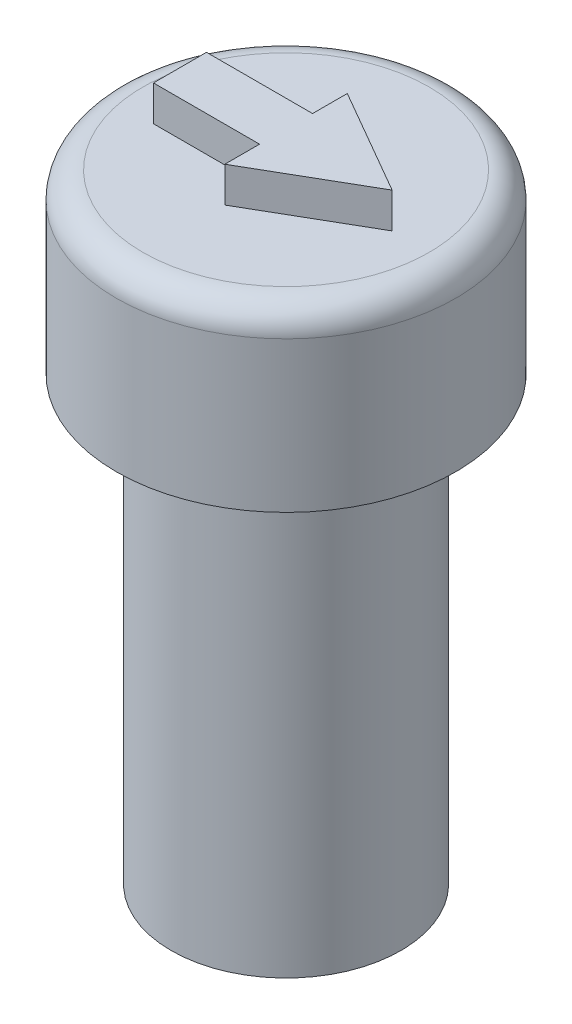
ISO-10303-21;
HEADER;
FILE_DESCRIPTION(('STEP AP214'),'2;1');
FILE_NAME('part.step','',(''),(''),'','','');
FILE_SCHEMA(('AUTOMOTIVE_DESIGN { 1 0 10303 214 1 1 1 1 }'));
ENDSEC;
DATA;
#1=APPLICATION_CONTEXT('core data for automotive mechanical design processes');
#2=APPLICATION_PROTOCOL_DEFINITION('international standard','automotive_design',2000,#1);
#3=PRODUCT_CONTEXT('',#1,'mechanical');
#4=PRODUCT('Part','Part','',(#3));
#5=PRODUCT_RELATED_PRODUCT_CATEGORY('part','',(#4));
#6=PRODUCT_DEFINITION_FORMATION('','',#4);
#7=PRODUCT_DEFINITION_CONTEXT('part definition',#1,'design');
#8=PRODUCT_DEFINITION('design','',#6,#7);
#9=PRODUCT_DEFINITION_SHAPE('','',#8);
#10=(LENGTH_UNIT() NAMED_UNIT(*) SI_UNIT(.MILLI.,.METRE.));
#11=(NAMED_UNIT(*) PLANE_ANGLE_UNIT() SI_UNIT($,.RADIAN.));
#12=(NAMED_UNIT(*) SI_UNIT($,.STERADIAN.) SOLID_ANGLE_UNIT());
#13=UNCERTAINTY_MEASURE_WITH_UNIT(LENGTH_MEASURE(1.E-05),#10,'distance_accuracy_value','');
#14=(GEOMETRIC_REPRESENTATION_CONTEXT(3) GLOBAL_UNCERTAINTY_ASSIGNED_CONTEXT((#13)) GLOBAL_UNIT_ASSIGNED_CONTEXT((#10,
#11,#12)) REPRESENTATION_CONTEXT('',''));
#15=CARTESIAN_POINT('',(0.,0.,0.));
#16=DIRECTION('',(0.,0.,1.));
#17=DIRECTION('',(1.,0.,0.));
#18=AXIS2_PLACEMENT_3D('',#15,#16,#17);
#19=CARTESIAN_POINT('',(0.,17.5,0.));
#20=DIRECTION('',(0.,1.,0.));
#21=DIRECTION('',(0.,0.,1.));
#22=AXIS2_PLACEMENT_3D('',#19,#20,#21);
#23=PLANE('',#22);
#24=CARTESIAN_POINT('',(0.,17.5,0.));
#25=DIRECTION('',(0.,1.,0.));
#26=DIRECTION('',(0.,0.,1.));
#27=AXIS2_PLACEMENT_3D('',#24,#25,#26);
#28=CIRCLE('',#27,4.05);
#29=CARTESIAN_POINT('',(0.,17.5,4.05));
#30=VERTEX_POINT('',#29);
#31=EDGE_CURVE('E110',#30,#30,#28,.T.);
#32=ORIENTED_EDGE('',*,*,#31,.T.);
#33=EDGE_LOOP('',(#32));
#34=FACE_BOUND('',#33,.T.);
#35=DIRECTION('',(-1.,0.,0.));
#36=VECTOR('',#35,1.);
#37=CARTESIAN_POINT('',(0.,17.5,-0.75));
#38=LINE('',#37,#36);
#39=CARTESIAN_POINT('',(0.,17.5,-0.75));
#40=VERTEX_POINT('',#39);
#41=CARTESIAN_POINT('',(-3.,17.5,-0.75));
#42=VERTEX_POINT('',#41);
#43=EDGE_CURVE('E200',#40,#42,#38,.T.);
#44=ORIENTED_EDGE('',*,*,#43,.F.);
#45=DIRECTION('',(0.,0.,1.));
#46=VECTOR('',#45,1.);
#47=CARTESIAN_POINT('',(0.,17.5,-1.73205080756888));
#48=LINE('',#47,#46);
#49=CARTESIAN_POINT('',(0.,17.5,-1.73205080756888));
#50=VERTEX_POINT('',#49);
#51=EDGE_CURVE('E196',#50,#40,#48,.T.);
#52=ORIENTED_EDGE('',*,*,#51,.F.);
#53=DIRECTION('',(-0.866025403784438,0.,-0.5));
#54=VECTOR('',#53,1.);
#55=CARTESIAN_POINT('',(3.,17.5,0.));
#56=LINE('',#55,#54);
#57=CARTESIAN_POINT('',(3.,17.5,0.));
#58=VERTEX_POINT('',#57);
#59=EDGE_CURVE('E148',#58,#50,#56,.T.);
#60=ORIENTED_EDGE('',*,*,#59,.F.);
#61=DIRECTION('',(0.866025403784439,0.,-0.5));
#62=VECTOR('',#61,1.);
#63=CARTESIAN_POINT('',(0.,17.5,1.73205080756888));
#64=LINE('',#63,#62);
#65=CARTESIAN_POINT('',(0.,17.5,1.73205080756888));
#66=VERTEX_POINT('',#65);
#67=EDGE_CURVE('E211',#66,#58,#64,.T.);
#68=ORIENTED_EDGE('',*,*,#67,.F.);
#69=DIRECTION('',(0.,0.,1.));
#70=VECTOR('',#69,1.);
#71=CARTESIAN_POINT('',(0.,17.5,0.75));
#72=LINE('',#71,#70);
#73=CARTESIAN_POINT('',(0.,17.5,0.75));
#74=VERTEX_POINT('',#73);
#75=EDGE_CURVE('E182',#74,#66,#72,.T.);
#76=ORIENTED_EDGE('',*,*,#75,.F.);
#77=DIRECTION('',(1.,0.,0.));
#78=VECTOR('',#77,1.);
#79=CARTESIAN_POINT('',(-3.,17.5,0.75));
#80=LINE('',#79,#78);
#81=CARTESIAN_POINT('',(-3.,17.5,0.75));
#82=VERTEX_POINT('',#81);
#83=EDGE_CURVE('E206',#82,#74,#80,.T.);
#84=ORIENTED_EDGE('',*,*,#83,.F.);
#85=DIRECTION('',(0.,0.,1.));
#86=VECTOR('',#85,1.);
#87=CARTESIAN_POINT('',(-3.,17.5,-0.75));
#88=LINE('',#87,#86);
#89=EDGE_CURVE('E203',#42,#82,#88,.T.);
#90=ORIENTED_EDGE('',*,*,#89,.F.);
#91=EDGE_LOOP('',(#44,#52,#60,#68,#76,#84,#90));
#92=FACE_BOUND('',#91,.T.);
#93=ADVANCED_FACE('F101',(#34,#92),#23,.T.);
#94=CARTESIAN_POINT('',(0.,12.5,0.));
#95=DIRECTION('',(0.,-1.,0.));
#96=DIRECTION('',(0.,0.,-1.));
#97=AXIS2_PLACEMENT_3D('',#94,#95,#96);
#98=CYLINDRICAL_SURFACE('',#97,3.25);
#99=CARTESIAN_POINT('',(0.,12.5,0.));
#100=DIRECTION('',(0.,1.,0.));
#101=DIRECTION('',(0.,0.,1.));
#102=AXIS2_PLACEMENT_3D('',#99,#100,#101);
#103=CIRCLE('',#102,3.25);
#104=CARTESIAN_POINT('',(0.,12.5,3.25));
#105=VERTEX_POINT('',#104);
#106=EDGE_CURVE('E247',#105,#105,#103,.T.);
#107=ORIENTED_EDGE('',*,*,#106,.F.);
#108=EDGE_LOOP('',(#107));
#109=FACE_BOUND('',#108,.T.);
#110=CARTESIAN_POINT('',(0.,0.,0.));
#111=DIRECTION('',(0.,1.,0.));
#112=DIRECTION('',(0.,0.,1.));
#113=AXIS2_PLACEMENT_3D('',#110,#111,#112);
#114=CIRCLE('',#113,3.25);
#115=CARTESIAN_POINT('',(0.,0.,3.25));
#116=VERTEX_POINT('',#115);
#117=EDGE_CURVE('E243',#116,#116,#114,.T.);
#118=ORIENTED_EDGE('',*,*,#117,.T.);
#119=EDGE_LOOP('',(#118));
#120=FACE_BOUND('',#119,.T.);
#121=ADVANCED_FACE('F276',(#109,#120),#98,.T.);
#122=CARTESIAN_POINT('',(0.,0.,0.));
#123=DIRECTION('',(0.,1.,0.));
#124=DIRECTION('',(0.,0.,1.));
#125=AXIS2_PLACEMENT_3D('',#122,#123,#124);
#126=PLANE('',#125);
#127=CARTESIAN_POINT('',(0.,0.,0.));
#128=DIRECTION('',(0.,-1.,0.));
#129=DIRECTION('',(0.,0.,-1.));
#130=AXIS2_PLACEMENT_3D('',#127,#128,#129);
#131=CIRCLE('',#130,1.75);
#132=CARTESIAN_POINT('',(0.,0.,-1.75));
#133=VERTEX_POINT('',#132);
#134=EDGE_CURVE('E238',#133,#133,#131,.T.);
#135=ORIENTED_EDGE('',*,*,#134,.F.);
#136=EDGE_LOOP('',(#135));
#137=FACE_BOUND('',#136,.T.);
#138=ORIENTED_EDGE('',*,*,#117,.F.);
#139=EDGE_LOOP('',(#138));
#140=FACE_BOUND('',#139,.T.);
#141=ADVANCED_FACE('F281',(#137,#140),#126,.F.);
#142=CARTESIAN_POINT('',(0.,2.5,0.));
#143=DIRECTION('',(0.,-1.,0.));
#144=DIRECTION('',(0.,0.,-1.));
#145=AXIS2_PLACEMENT_3D('',#142,#143,#144);
#146=CYLINDRICAL_SURFACE('',#145,1.75);
#147=CARTESIAN_POINT('',(0.,2.5,0.));
#148=DIRECTION('',(0.,-1.,0.));
#149=DIRECTION('',(0.,0.,-1.));
#150=AXIS2_PLACEMENT_3D('',#147,#148,#149);
#151=CIRCLE('',#150,1.75);
#152=CARTESIAN_POINT('',(0.,2.5,-1.75));
#153=VERTEX_POINT('',#152);
#154=EDGE_CURVE('E239',#153,#153,#151,.T.);
#155=ORIENTED_EDGE('',*,*,#154,.F.);
#156=EDGE_LOOP('',(#155));
#157=FACE_BOUND('',#156,.T.);
#158=ORIENTED_EDGE('',*,*,#134,.T.);
#159=EDGE_LOOP('',(#158));
#160=FACE_BOUND('',#159,.T.);
#161=ADVANCED_FACE('F290',(#157,#160),#146,.F.);
#162=CARTESIAN_POINT('',(0.,2.5,0.));
#163=DIRECTION('',(0.,-1.,0.));
#164=DIRECTION('',(0.,0.,-1.));
#165=AXIS2_PLACEMENT_3D('',#162,#163,#164);
#166=PLANE('',#165);
#167=ORIENTED_EDGE('',*,*,#154,.T.);
#168=EDGE_LOOP('',(#167));
#169=FACE_BOUND('',#168,.T.);
#170=ADVANCED_FACE('F286',(#169),#166,.T.);
#171=CARTESIAN_POINT('',(0.,17.5,0.));
#172=DIRECTION('',(0.,-1.,0.));
#173=DIRECTION('',(0.,0.,-1.));
#174=AXIS2_PLACEMENT_3D('',#171,#172,#173);
#175=CYLINDRICAL_SURFACE('',#174,4.8);
#176=CARTESIAN_POINT('',(0.,16.75,0.));
#177=DIRECTION('',(0.,1.,0.));
#178=DIRECTION('',(0.,0.,1.));
#179=AXIS2_PLACEMENT_3D('',#176,#177,#178);
#180=CIRCLE('',#179,4.8);
#181=CARTESIAN_POINT('',(0.,16.75,4.8));
#182=VERTEX_POINT('',#181);
#183=EDGE_CURVE('E12',#182,#182,#180,.F.);
#184=ORIENTED_EDGE('',*,*,#183,.T.);
#185=EDGE_LOOP('',(#184));
#186=FACE_BOUND('',#185,.T.);
#187=CARTESIAN_POINT('',(0.,12.5,0.));
#188=DIRECTION('',(0.,1.,0.));
#189=DIRECTION('',(0.,0.,1.));
#190=AXIS2_PLACEMENT_3D('',#187,#188,#189);
#191=CIRCLE('',#190,4.8);
#192=CARTESIAN_POINT('',(0.,12.5,4.8));
#193=VERTEX_POINT('',#192);
#194=EDGE_CURVE('E234',#193,#193,#191,.T.);
#195=ORIENTED_EDGE('',*,*,#194,.T.);
#196=EDGE_LOOP('',(#195));
#197=FACE_BOUND('',#196,.T.);
#198=ADVANCED_FACE('F272',(#186,#197),#175,.T.);
#199=CARTESIAN_POINT('',(0.,12.5,0.));
#200=DIRECTION('',(0.,1.,0.));
#201=DIRECTION('',(0.,0.,1.));
#202=AXIS2_PLACEMENT_3D('',#199,#200,#201);
#203=PLANE('',#202);
#204=ORIENTED_EDGE('',*,*,#106,.T.);
#205=EDGE_LOOP('',(#204));
#206=FACE_BOUND('',#205,.T.);
#207=ORIENTED_EDGE('',*,*,#194,.F.);
#208=EDGE_LOOP('',(#207));
#209=FACE_BOUND('',#208,.T.);
#210=ADVANCED_FACE('F261',(#206,#209),#203,.F.);
#211=CARTESIAN_POINT('',(0.,16.75,0.));
#212=DIRECTION('',(0.,1.,0.));
#213=DIRECTION('',(0.,0.,1.));
#214=AXIS2_PLACEMENT_3D('',#211,#212,#213);
#215=TOROIDAL_SURFACE('',#214,4.05,0.75);
#216=ORIENTED_EDGE('',*,*,#183,.F.);
#217=EDGE_LOOP('',(#216));
#218=FACE_BOUND('',#217,.T.);
#219=ORIENTED_EDGE('',*,*,#31,.F.);
#220=EDGE_LOOP('',(#219));
#221=FACE_BOUND('',#220,.T.);
#222=ADVANCED_FACE('F103',(#218,#221),#215,.T.);
#223=CARTESIAN_POINT('',(0.,18.5,-1.73205080756888));
#224=DIRECTION('',(1.,0.,0.));
#225=DIRECTION('',(0.,0.,-1.));
#226=AXIS2_PLACEMENT_3D('',#223,#224,#225);
#227=PLANE('',#226);
#228=ORIENTED_EDGE('',*,*,#51,.T.);
#229=DIRECTION('',(0.,-1.,0.));
#230=VECTOR('',#229,1.);
#231=CARTESIAN_POINT('',(0.,18.5,-0.75));
#232=LINE('',#231,#230);
#233=CARTESIAN_POINT('',(0.,18.5,-0.75));
#234=VERTEX_POINT('',#233);
#235=EDGE_CURVE('E231',#234,#40,#232,.T.);
#236=ORIENTED_EDGE('',*,*,#235,.F.);
#237=DIRECTION('',(0.,0.,1.));
#238=VECTOR('',#237,1.);
#239=CARTESIAN_POINT('',(0.,18.5,-1.73205080756888));
#240=LINE('',#239,#238);
#241=CARTESIAN_POINT('',(0.,18.5,-1.73205080756888));
#242=VERTEX_POINT('',#241);
#243=EDGE_CURVE('E216',#242,#234,#240,.T.);
#244=ORIENTED_EDGE('',*,*,#243,.F.);
#245=DIRECTION('',(0.,-1.,0.));
#246=VECTOR('',#245,1.);
#247=CARTESIAN_POINT('',(0.,18.5,-1.73205080756888));
#248=LINE('',#247,#246);
#249=EDGE_CURVE('E192',#242,#50,#248,.T.);
#250=ORIENTED_EDGE('',*,*,#249,.T.);
#251=EDGE_LOOP('',(#228,#236,#244,#250));
#252=FACE_BOUND('',#251,.T.);
#253=ADVANCED_FACE('F260',(#252),#227,.F.);
#254=CARTESIAN_POINT('',(0.,18.5,-0.75));
#255=DIRECTION('',(0.,0.,1.));
#256=DIRECTION('',(1.,0.,0.));
#257=AXIS2_PLACEMENT_3D('',#254,#255,#256);
#258=PLANE('',#257);
#259=ORIENTED_EDGE('',*,*,#43,.T.);
#260=DIRECTION('',(0.,-1.,0.));
#261=VECTOR('',#260,1.);
#262=CARTESIAN_POINT('',(-3.,18.5,-0.75));
#263=LINE('',#262,#261);
#264=CARTESIAN_POINT('',(-3.,18.5,-0.75));
#265=VERTEX_POINT('',#264);
#266=EDGE_CURVE('E227',#265,#42,#263,.T.);
#267=ORIENTED_EDGE('',*,*,#266,.F.);
#268=DIRECTION('',(-1.,0.,0.));
#269=VECTOR('',#268,1.);
#270=CARTESIAN_POINT('',(0.,18.5,-0.75));
#271=LINE('',#270,#269);
#272=EDGE_CURVE('E156',#234,#265,#271,.T.);
#273=ORIENTED_EDGE('',*,*,#272,.F.);
#274=ORIENTED_EDGE('',*,*,#235,.T.);
#275=EDGE_LOOP('',(#259,#267,#273,#274));
#276=FACE_BOUND('',#275,.T.);
#277=ADVANCED_FACE('F268',(#276),#258,.F.);
#278=CARTESIAN_POINT('',(-3.,18.5,-0.75));
#279=DIRECTION('',(1.,0.,0.));
#280=DIRECTION('',(0.,0.,-1.));
#281=AXIS2_PLACEMENT_3D('',#278,#279,#280);
#282=PLANE('',#281);
#283=ORIENTED_EDGE('',*,*,#89,.T.);
#284=DIRECTION('',(0.,-1.,0.));
#285=VECTOR('',#284,1.);
#286=CARTESIAN_POINT('',(-3.,18.5,0.75));
#287=LINE('',#286,#285);
#288=CARTESIAN_POINT('',(-3.,18.5,0.75));
#289=VERTEX_POINT('',#288);
#290=EDGE_CURVE('E223',#289,#82,#287,.T.);
#291=ORIENTED_EDGE('',*,*,#290,.F.);
#292=DIRECTION('',(0.,0.,1.));
#293=VECTOR('',#292,1.);
#294=CARTESIAN_POINT('',(-3.,18.5,-0.75));
#295=LINE('',#294,#293);
#296=EDGE_CURVE('E416',#265,#289,#295,.T.);
#297=ORIENTED_EDGE('',*,*,#296,.F.);
#298=ORIENTED_EDGE('',*,*,#266,.T.);
#299=EDGE_LOOP('',(#283,#291,#297,#298));
#300=FACE_BOUND('',#299,.T.);
#301=ADVANCED_FACE('F350',(#300),#282,.F.);
#302=CARTESIAN_POINT('',(-3.,18.5,0.75));
#303=DIRECTION('',(0.,0.,-1.));
#304=DIRECTION('',(-1.,0.,0.));
#305=AXIS2_PLACEMENT_3D('',#302,#303,#304);
#306=PLANE('',#305);
#307=ORIENTED_EDGE('',*,*,#83,.T.);
#308=DIRECTION('',(0.,-1.,0.));
#309=VECTOR('',#308,1.);
#310=CARTESIAN_POINT('',(0.,18.5,0.75));
#311=LINE('',#310,#309);
#312=CARTESIAN_POINT('',(0.,18.5,0.75));
#313=VERTEX_POINT('',#312);
#314=EDGE_CURVE('E186',#313,#74,#311,.T.);
#315=ORIENTED_EDGE('',*,*,#314,.F.);
#316=DIRECTION('',(1.,0.,0.));
#317=VECTOR('',#316,1.);
#318=CARTESIAN_POINT('',(-3.,18.5,0.75));
#319=LINE('',#318,#317);
#320=EDGE_CURVE('E172',#289,#313,#319,.T.);
#321=ORIENTED_EDGE('',*,*,#320,.F.);
#322=ORIENTED_EDGE('',*,*,#290,.T.);
#323=EDGE_LOOP('',(#307,#315,#321,#322));
#324=FACE_BOUND('',#323,.T.);
#325=ADVANCED_FACE('F357',(#324),#306,.F.);
#326=CARTESIAN_POINT('',(0.,18.5,0.75));
#327=DIRECTION('',(1.,0.,0.));
#328=DIRECTION('',(0.,0.,-1.));
#329=AXIS2_PLACEMENT_3D('',#326,#327,#328);
#330=PLANE('',#329);
#331=ORIENTED_EDGE('',*,*,#75,.T.);
#332=DIRECTION('',(0.,-1.,0.));
#333=VECTOR('',#332,1.);
#334=CARTESIAN_POINT('',(0.,18.5,1.73205080756888));
#335=LINE('',#334,#333);
#336=CARTESIAN_POINT('',(0.,18.5,1.73205080756888));
#337=VERTEX_POINT('',#336);
#338=EDGE_CURVE('E179',#337,#66,#335,.T.);
#339=ORIENTED_EDGE('',*,*,#338,.F.);
#340=DIRECTION('',(0.,0.,1.));
#341=VECTOR('',#340,1.);
#342=CARTESIAN_POINT('',(0.,18.5,0.75));
#343=LINE('',#342,#341);
#344=EDGE_CURVE('E166',#313,#337,#343,.T.);
#345=ORIENTED_EDGE('',*,*,#344,.F.);
#346=ORIENTED_EDGE('',*,*,#314,.T.);
#347=EDGE_LOOP('',(#331,#339,#345,#346));
#348=FACE_BOUND('',#347,.T.);
#349=ADVANCED_FACE('F180',(#348),#330,.F.);
#350=CARTESIAN_POINT('',(0.,18.5,1.73205080756888));
#351=DIRECTION('',(-0.5,0.,-0.866025403784439));
#352=DIRECTION('',(-0.866025403784439,0.,0.5));
#353=AXIS2_PLACEMENT_3D('',#350,#351,#352);
#354=PLANE('',#353);
#355=ORIENTED_EDGE('',*,*,#67,.T.);
#356=DIRECTION('',(0.,-1.,0.));
#357=VECTOR('',#356,1.);
#358=CARTESIAN_POINT('',(3.,18.5,0.));
#359=LINE('',#358,#357);
#360=CARTESIAN_POINT('',(3.,18.5,0.));
#361=VERTEX_POINT('',#360);
#362=EDGE_CURVE('E117',#361,#58,#359,.T.);
#363=ORIENTED_EDGE('',*,*,#362,.F.);
#364=DIRECTION('',(0.866025403784439,0.,-0.5));
#365=VECTOR('',#364,1.);
#366=CARTESIAN_POINT('',(0.,18.5,1.73205080756888));
#367=LINE('',#366,#365);
#368=EDGE_CURVE('E170',#337,#361,#367,.T.);
#369=ORIENTED_EDGE('',*,*,#368,.F.);
#370=ORIENTED_EDGE('',*,*,#338,.T.);
#371=EDGE_LOOP('',(#355,#363,#369,#370));
#372=FACE_BOUND('',#371,.T.);
#373=ADVANCED_FACE('F188',(#372),#354,.F.);
#374=CARTESIAN_POINT('',(3.,18.5,0.));
#375=DIRECTION('',(-0.5,0.,0.866025403784438));
#376=DIRECTION('',(0.866025403784438,0.,0.5));
#377=AXIS2_PLACEMENT_3D('',#374,#375,#376);
#378=PLANE('',#377);
#379=ORIENTED_EDGE('',*,*,#59,.T.);
#380=ORIENTED_EDGE('',*,*,#249,.F.);
#381=DIRECTION('',(-0.866025403784438,0.,-0.5));
#382=VECTOR('',#381,1.);
#383=CARTESIAN_POINT('',(3.,18.5,0.));
#384=LINE('',#383,#382);
#385=EDGE_CURVE('E125',#361,#242,#384,.T.);
#386=ORIENTED_EDGE('',*,*,#385,.F.);
#387=ORIENTED_EDGE('',*,*,#362,.T.);
#388=EDGE_LOOP('',(#379,#380,#386,#387));
#389=FACE_BOUND('',#388,.T.);
#390=ADVANCED_FACE('F381',(#389),#378,.F.);
#391=CARTESIAN_POINT('',(0.,18.5,0.));
#392=DIRECTION('',(0.,-1.,0.));
#393=DIRECTION('',(0.,0.,-1.));
#394=AXIS2_PLACEMENT_3D('',#391,#392,#393);
#395=PLANE('',#394);
#396=ORIENTED_EDGE('',*,*,#243,.T.);
#397=ORIENTED_EDGE('',*,*,#272,.T.);
#398=ORIENTED_EDGE('',*,*,#296,.T.);
#399=ORIENTED_EDGE('',*,*,#320,.T.);
#400=ORIENTED_EDGE('',*,*,#344,.T.);
#401=ORIENTED_EDGE('',*,*,#368,.T.);
#402=ORIENTED_EDGE('',*,*,#385,.T.);
#403=EDGE_LOOP('',(#396,#397,#398,#399,#400,#401,#402));
#404=FACE_BOUND('',#403,.T.);
#405=ADVANCED_FACE('F168',(#404),#395,.F.);
#406=CLOSED_SHELL('',(#93,#121,#141,#161,#170,#198,#210,#222,#253,#277,#301,#325,#349,#373,#390,#405));
#407=MANIFOLD_SOLID_BREP('B2',#406);
#408=ADVANCED_BREP_SHAPE_REPRESENTATION('',(#18,#407),#14);
#409=SHAPE_DEFINITION_REPRESENTATION(#9,#408);
ENDSEC;
END-ISO-10303-21;
